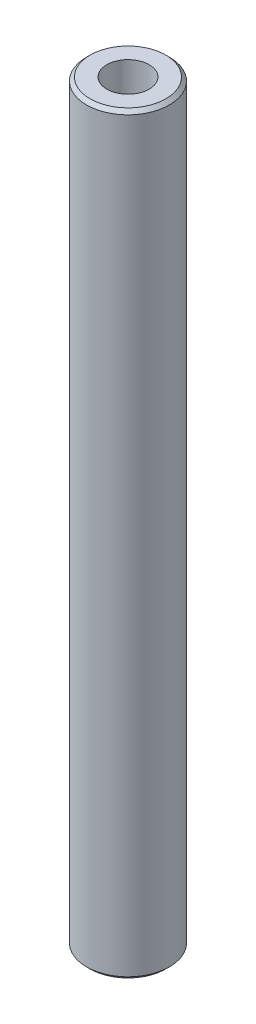
ISO-10303-21;
HEADER;
FILE_DESCRIPTION(('STEP AP214'),'2;1');
FILE_NAME('part.step','',(''),(''),'','','');
FILE_SCHEMA(('AUTOMOTIVE_DESIGN { 1 0 10303 214 1 1 1 1 }'));
ENDSEC;
DATA;
#1=APPLICATION_CONTEXT('core data for automotive mechanical design processes');
#2=APPLICATION_PROTOCOL_DEFINITION('international standard','automotive_design',2000,#1);
#3=PRODUCT_CONTEXT('',#1,'mechanical');
#4=PRODUCT('Part','Part','',(#3));
#5=PRODUCT_RELATED_PRODUCT_CATEGORY('part','',(#4));
#6=PRODUCT_DEFINITION_FORMATION('','',#4);
#7=PRODUCT_DEFINITION_CONTEXT('part definition',#1,'design');
#8=PRODUCT_DEFINITION('design','',#6,#7);
#9=PRODUCT_DEFINITION_SHAPE('','',#8);
#10=(LENGTH_UNIT() NAMED_UNIT(*) SI_UNIT(.MILLI.,.METRE.));
#11=(NAMED_UNIT(*) PLANE_ANGLE_UNIT() SI_UNIT($,.RADIAN.));
#12=(NAMED_UNIT(*) SI_UNIT($,.STERADIAN.) SOLID_ANGLE_UNIT());
#13=UNCERTAINTY_MEASURE_WITH_UNIT(LENGTH_MEASURE(1.E-05),#10,'distance_accuracy_value','');
#14=(GEOMETRIC_REPRESENTATION_CONTEXT(3) GLOBAL_UNCERTAINTY_ASSIGNED_CONTEXT((#13)) GLOBAL_UNIT_ASSIGNED_CONTEXT((#10,
#11,#12)) REPRESENTATION_CONTEXT('',''));
#15=CARTESIAN_POINT('',(0.,0.,0.));
#16=DIRECTION('',(0.,0.,1.));
#17=DIRECTION('',(1.,0.,0.));
#18=AXIS2_PLACEMENT_3D('',#15,#16,#17);
#19=CARTESIAN_POINT('',(0.,500.211161865141,0.));
#20=DIRECTION('',(0.,-1.,0.));
#21=DIRECTION('',(0.,0.,-1.));
#22=AXIS2_PLACEMENT_3D('',#19,#20,#21);
#23=CYLINDRICAL_SURFACE('',#22,27.5);
#24=CARTESIAN_POINT('',(0.,497.855403772505,0.));
#25=DIRECTION('',(0.,1.,0.));
#26=DIRECTION('',(0.,0.,1.));
#27=AXIS2_PLACEMENT_3D('',#24,#25,#26);
#28=CIRCLE('',#27,27.5);
#29=CARTESIAN_POINT('',(0.,497.855403772505,27.5));
#30=VERTEX_POINT('',#29);
#31=EDGE_CURVE('E50',#30,#30,#28,.F.);
#32=ORIENTED_EDGE('',*,*,#31,.T.);
#33=EDGE_LOOP('',(#32));
#34=FACE_BOUND('',#33,.T.);
#35=CARTESIAN_POINT('',(0.,2.35575809263611,0.));
#36=DIRECTION('',(0.,1.,0.));
#37=DIRECTION('',(0.,0.,1.));
#38=AXIS2_PLACEMENT_3D('',#35,#36,#37);
#39=CIRCLE('',#38,27.5);
#40=CARTESIAN_POINT('',(0.,2.35575809263611,27.5));
#41=VERTEX_POINT('',#40);
#42=EDGE_CURVE('E51',#41,#41,#39,.T.);
#43=ORIENTED_EDGE('',*,*,#42,.T.);
#44=EDGE_LOOP('',(#43));
#45=FACE_BOUND('',#44,.T.);
#46=ADVANCED_FACE('F39',(#34,#45),#23,.T.);
#47=CARTESIAN_POINT('',(0.,500.211161865141,0.));
#48=DIRECTION('',(0.,1.,0.));
#49=DIRECTION('',(0.,0.,1.));
#50=AXIS2_PLACEMENT_3D('',#47,#48,#49);
#51=PLANE('',#50);
#52=CARTESIAN_POINT('',(0.,500.211161865141,0.));
#53=DIRECTION('',(0.,1.,0.));
#54=DIRECTION('',(0.,0.,1.));
#55=AXIS2_PLACEMENT_3D('',#52,#53,#54);
#56=CIRCLE('',#55,25.1442419073637);
#57=CARTESIAN_POINT('',(0.,500.211161865141,25.1442419073637));
#58=VERTEX_POINT('',#57);
#59=EDGE_CURVE('E54',#58,#58,#56,.T.);
#60=ORIENTED_EDGE('',*,*,#59,.T.);
#61=EDGE_LOOP('',(#60));
#62=FACE_BOUND('',#61,.T.);
#63=CARTESIAN_POINT('',(0.,500.211161865141,0.));
#64=DIRECTION('',(0.,1.,0.));
#65=DIRECTION('',(0.,0.,1.));
#66=AXIS2_PLACEMENT_3D('',#63,#64,#65);
#67=CIRCLE('',#66,14.0832302932276);
#68=CARTESIAN_POINT('',(0.,500.211161865141,14.0832302932276));
#69=VERTEX_POINT('',#68);
#70=EDGE_CURVE('E58',#69,#69,#67,.T.);
#71=ORIENTED_EDGE('',*,*,#70,.F.);
#72=EDGE_LOOP('',(#71));
#73=FACE_BOUND('',#72,.T.);
#74=ADVANCED_FACE('F69',(#62,#73),#51,.T.);
#75=CARTESIAN_POINT('',(0.,0.,0.));
#76=DIRECTION('',(0.,1.,0.));
#77=DIRECTION('',(0.,0.,1.));
#78=AXIS2_PLACEMENT_3D('',#75,#76,#77);
#79=PLANE('',#78);
#80=CARTESIAN_POINT('',(0.,0.,0.));
#81=DIRECTION('',(0.,1.,0.));
#82=DIRECTION('',(0.,0.,1.));
#83=AXIS2_PLACEMENT_3D('',#80,#81,#82);
#84=CIRCLE('',#83,25.1442419073639);
#85=CARTESIAN_POINT('',(0.,0.,25.1442419073639));
#86=VERTEX_POINT('',#85);
#87=EDGE_CURVE('E10',#86,#86,#84,.F.);
#88=ORIENTED_EDGE('',*,*,#87,.T.);
#89=EDGE_LOOP('',(#88));
#90=FACE_BOUND('',#89,.T.);
#91=CARTESIAN_POINT('',(0.,0.,0.));
#92=DIRECTION('',(0.,1.,0.));
#93=DIRECTION('',(0.,0.,1.));
#94=AXIS2_PLACEMENT_3D('',#91,#92,#93);
#95=CIRCLE('',#94,14.0832302932276);
#96=CARTESIAN_POINT('',(0.,0.,14.0832302932276));
#97=VERTEX_POINT('',#96);
#98=EDGE_CURVE('E63',#97,#97,#95,.T.);
#99=ORIENTED_EDGE('',*,*,#98,.T.);
#100=EDGE_LOOP('',(#99));
#101=FACE_BOUND('',#100,.T.);
#102=ADVANCED_FACE('F75',(#90,#101),#79,.F.);
#103=CARTESIAN_POINT('',(0.,500.211161865141,0.));
#104=DIRECTION('',(0.,-1.,0.));
#105=DIRECTION('',(0.,0.,-1.));
#106=AXIS2_PLACEMENT_3D('',#103,#104,#105);
#107=CYLINDRICAL_SURFACE('',#106,14.0832302932276);
#108=ORIENTED_EDGE('',*,*,#70,.T.);
#109=EDGE_LOOP('',(#108));
#110=FACE_BOUND('',#109,.T.);
#111=ORIENTED_EDGE('',*,*,#98,.F.);
#112=EDGE_LOOP('',(#111));
#113=FACE_BOUND('',#112,.T.);
#114=ADVANCED_FACE('F70',(#110,#113),#107,.F.);
#115=CARTESIAN_POINT('',(0.,500.211161865141,0.));
#116=DIRECTION('',(0.,-1.,0.));
#117=DIRECTION('',(0.,0.,-1.));
#118=AXIS2_PLACEMENT_3D('',#115,#116,#117);
#119=CONICAL_SURFACE('',#118,25.1442419073637,0.785398163397456);
#120=ORIENTED_EDGE('',*,*,#31,.F.);
#121=EDGE_LOOP('',(#120));
#122=FACE_BOUND('',#121,.T.);
#123=ORIENTED_EDGE('',*,*,#59,.F.);
#124=EDGE_LOOP('',(#123));
#125=FACE_BOUND('',#124,.T.);
#126=ADVANCED_FACE('F81',(#122,#125),#119,.T.);
#127=CARTESIAN_POINT('',(0.,2.35575809263611,0.));
#128=DIRECTION('',(0.,1.,0.));
#129=DIRECTION('',(0.,0.,1.));
#130=AXIS2_PLACEMENT_3D('',#127,#128,#129);
#131=CONICAL_SURFACE('',#130,27.5,0.785398163397444);
#132=CARTESIAN_POINT('',(0.,0.,25.1442419073639));
#133=CARTESIAN_POINT('',(0.,0.0245391467982915,25.1687810541622));
#134=CARTESIAN_POINT('',(0.,0.0490782935965845,25.1933202009605));
#135=CARTESIAN_POINT('',(0.,0.0981565871931707,25.2423984945571));
#136=CARTESIAN_POINT('',(0.,0.122695733991464,25.2669376413554));
#137=CARTESIAN_POINT('',(0.,0.171774027588049,25.316015934952));
#138=CARTESIAN_POINT('',(0.,0.196313174386342,25.3405550817503));
#139=CARTESIAN_POINT('',(0.,0.245391467982927,25.3896333753468));
#140=CARTESIAN_POINT('',(0.,0.26993061478122,25.4141725221451));
#141=CARTESIAN_POINT('',(0.,0.319008908377806,25.4632508157417));
#142=CARTESIAN_POINT('',(0.,0.343548055176099,25.48778996254));
#143=CARTESIAN_POINT('',(0.,0.392626348772684,25.5368682561366));
#144=CARTESIAN_POINT('',(0.,0.417165495570976,25.5614074029349));
#145=CARTESIAN_POINT('',(0.,0.466243789167562,25.6104856965315));
#146=CARTESIAN_POINT('',(0.,0.490782935965855,25.6350248433298));
#147=CARTESIAN_POINT('',(0.,0.539861229562441,25.6841031369264));
#148=CARTESIAN_POINT('',(0.,0.564400376360733,25.7086422837246));
#149=CARTESIAN_POINT('',(0.,0.613478669957319,25.7577205773212));
#150=CARTESIAN_POINT('',(0.,0.638017816755612,25.7822597241195));
#151=CARTESIAN_POINT('',(0.,0.687096110352197,25.8313380177161));
#152=CARTESIAN_POINT('',(0.,0.71163525715049,25.8558771645144));
#153=CARTESIAN_POINT('',(0.,0.760713550747075,25.904955458111));
#154=CARTESIAN_POINT('',(0.,0.785252697545368,25.9294946049093));
#155=CARTESIAN_POINT('',(0.,0.834330991141954,25.9785728985059));
#156=CARTESIAN_POINT('',(0.,0.858870137940246,26.0031120453042));
#157=CARTESIAN_POINT('',(0.,0.907948431536832,26.0521903389007));
#158=CARTESIAN_POINT('',(0.,0.932487578335125,26.076729485699));
#159=CARTESIAN_POINT('',(0.,0.981565871931711,26.1258077792956));
#160=CARTESIAN_POINT('',(0.,1.00610501873,26.1503469260939));
#161=CARTESIAN_POINT('',(0.,1.05518331232659,26.1994252196905));
#162=CARTESIAN_POINT('',(0.,1.07972245912488,26.2239643664888));
#163=CARTESIAN_POINT('',(0.,1.12880075272147,26.2730426600854));
#164=CARTESIAN_POINT('',(0.,1.15333989951976,26.2975818068837));
#165=CARTESIAN_POINT('',(0.,1.20241819311635,26.3466601004803));
#166=CARTESIAN_POINT('',(0.,1.22695733991464,26.3711992472785));
#167=CARTESIAN_POINT('',(0.,1.27603563351122,26.4202775408751));
#168=CARTESIAN_POINT('',(0.,1.30057478030952,26.4448166876734));
#169=CARTESIAN_POINT('',(0.,1.3496530739061,26.49389498127));
#170=CARTESIAN_POINT('',(0.,1.3741922207044,26.5184341280683));
#171=CARTESIAN_POINT('',(0.,1.42327051430098,26.5675124216649));
#172=CARTESIAN_POINT('',(0.,1.44780966109927,26.5920515684632));
#173=CARTESIAN_POINT('',(0.,1.49688795469586,26.6411298620598));
#174=CARTESIAN_POINT('',(0.,1.52142710149415,26.6656690088581));
#175=CARTESIAN_POINT('',(0.,1.57050539509074,26.7147473024546));
#176=CARTESIAN_POINT('',(0.,1.59504454188903,26.7392864492529));
#177=CARTESIAN_POINT('',(0.,1.64412283548562,26.7883647428495));
#178=CARTESIAN_POINT('',(0.,1.66866198228391,26.8129038896478));
#179=CARTESIAN_POINT('',(0.,1.71774027588049,26.8619821832444));
#180=CARTESIAN_POINT('',(0.,1.74227942267879,26.8865213300427));
#181=CARTESIAN_POINT('',(0.,1.79135771627537,26.9355996236393));
#182=CARTESIAN_POINT('',(0.,1.81589686307367,26.9601387704376));
#183=CARTESIAN_POINT('',(0.,1.86497515667025,27.0092170640342));
#184=CARTESIAN_POINT('',(0.,1.88951430346854,27.0337562108324));
#185=CARTESIAN_POINT('',(0.,1.93859259706513,27.082834504429));
#186=CARTESIAN_POINT('',(0.,1.96313174386342,27.1073736512273));
#187=CARTESIAN_POINT('',(0.,2.01221003746001,27.1564519448239));
#188=CARTESIAN_POINT('',(0.,2.0367491842583,27.1809910916222));
#189=CARTESIAN_POINT('',(0.,2.08582747785489,27.2300693852188));
#190=CARTESIAN_POINT('',(0.,2.11036662465318,27.2546085320171));
#191=CARTESIAN_POINT('',(0.,2.15944491824976,27.3036868256137));
#192=CARTESIAN_POINT('',(0.,2.18398406504806,27.328225972412));
#193=CARTESIAN_POINT('',(0.,2.23306235864464,27.3773042660085));
#194=CARTESIAN_POINT('',(0.,2.25760150544294,27.4018434128068));
#195=CARTESIAN_POINT('',(0.,2.30667979903952,27.4509217064034));
#196=CARTESIAN_POINT('',(0.,2.33121894583781,27.4754608532017));
#197=CARTESIAN_POINT('',(0.,2.35575809263611,27.5));
#198=B_SPLINE_CURVE_WITH_KNOTS('',3,(#132,#133,#134,#135,#136,#137,#138,#139,#140,#141,#142,
#143,#144,#145,#146,#147,#148,#149,#150,#151,#152,#153,#154,#155,#156,#157,#158,#159,#160,#161,
#162,#163,#164,#165,#166,#167,#168,#169,#170,#171,#172,#173,#174,#175,#176,#177,#178,#179,#180,
#181,#182,#183,#184,#185,#186,#187,#188,#189,#190,#191,#192,#193,#194,#195,#196,#197),
.UNSPECIFIED.,.F.,.F.,(4,2,2,2,2,2,2,2,2,2,2,2,2,2,2,2,2,2,2,2,2,2,2,2,2,2,2,2,2,2,2,2,4),(0.,
0.10411078263363,0.208221565267257,0.312332347900887,0.416443130534517,0.520553913168147,
0.624664695801777,0.728775478435404,0.832886261069034,0.936997043702664,1.04110782633629,
1.14521860896992,1.24932939160355,1.35344017423718,1.45755095687081,1.56166173950444,
1.66577252213807,1.7698833047717,1.87399408740533,1.97810487003896,2.08221565267259,
2.18632643530622,2.29043721793985,2.39454800057348,2.49865878320711,2.60276956584074,
2.70688034847436,2.81099113110799,2.91510191374162,3.01921269637525,3.12332347900888,
3.22743426164251,3.33154504427614),.UNSPECIFIED.);
#199=EDGE_CURVE('BSEAM45',#86,#41,#198,.T.);
#200=ORIENTED_EDGE('',*,*,#87,.F.);
#201=ORIENTED_EDGE('',*,*,#42,.F.);
#202=ORIENTED_EDGE('',*,*,#199,.T.);
#203=ORIENTED_EDGE('',*,*,#199,.F.);
#204=EDGE_LOOP('',(#200,#202,#201,#203));
#205=FACE_BOUND('',#204,.T.);
#206=ADVANCED_FACE('F45',(#205),#131,.T.);
#207=CLOSED_SHELL('',(#46,#74,#102,#114,#126,#206));
#208=MANIFOLD_SOLID_BREP('B2',#207);
#209=ADVANCED_BREP_SHAPE_REPRESENTATION('',(#18,#208),#14);
#210=SHAPE_DEFINITION_REPRESENTATION(#9,#209);
ENDSEC;
END-ISO-10303-21;
